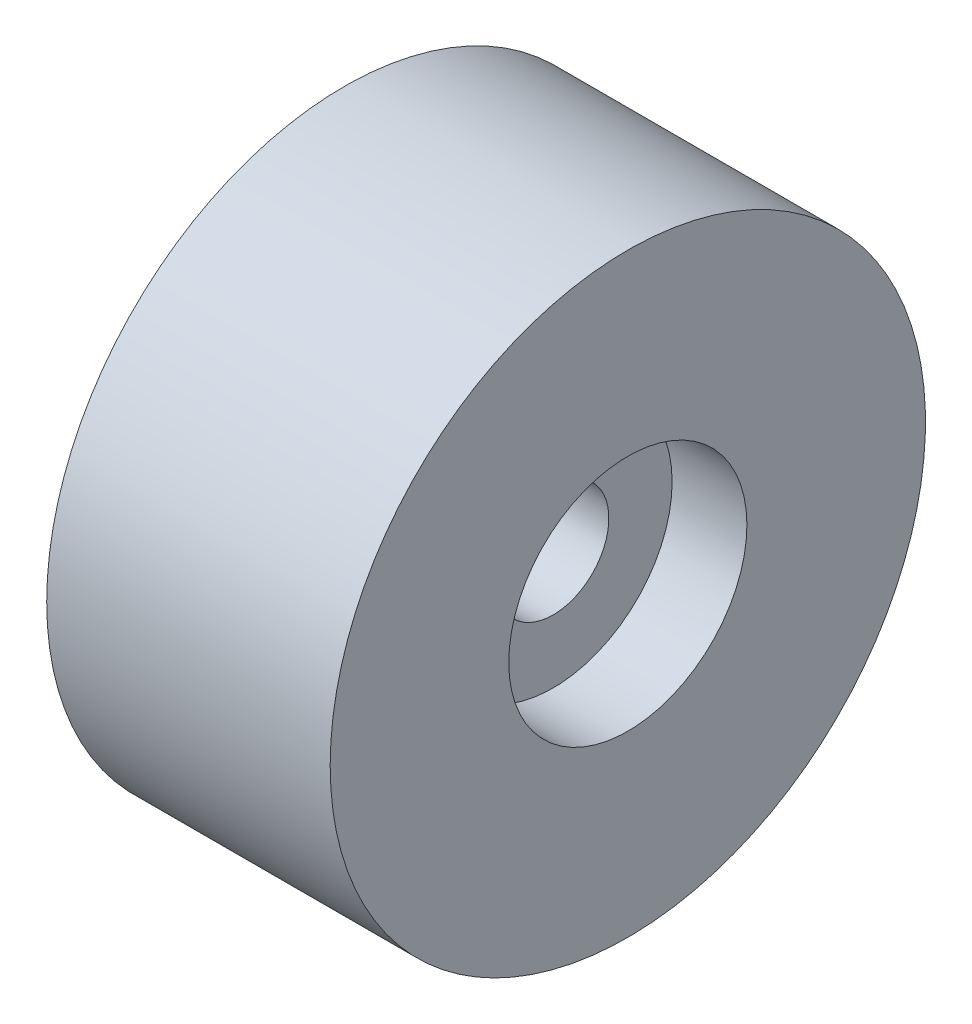
ISO-10303-21;
HEADER;
FILE_DESCRIPTION(('STEP AP214'),'2;1');
FILE_NAME('part.step','',(''),(''),'','','');
FILE_SCHEMA(('AUTOMOTIVE_DESIGN { 1 0 10303 214 1 1 1 1 }'));
ENDSEC;
DATA;
#1=APPLICATION_CONTEXT('core data for automotive mechanical design processes');
#2=APPLICATION_PROTOCOL_DEFINITION('international standard','automotive_design',2000,#1);
#3=PRODUCT_CONTEXT('',#1,'mechanical');
#4=PRODUCT('Part','Part','',(#3));
#5=PRODUCT_RELATED_PRODUCT_CATEGORY('part','',(#4));
#6=PRODUCT_DEFINITION_FORMATION('','',#4);
#7=PRODUCT_DEFINITION_CONTEXT('part definition',#1,'design');
#8=PRODUCT_DEFINITION('design','',#6,#7);
#9=PRODUCT_DEFINITION_SHAPE('','',#8);
#10=(LENGTH_UNIT() NAMED_UNIT(*) SI_UNIT(.MILLI.,.METRE.));
#11=(NAMED_UNIT(*) PLANE_ANGLE_UNIT() SI_UNIT($,.RADIAN.));
#12=(NAMED_UNIT(*) SI_UNIT($,.STERADIAN.) SOLID_ANGLE_UNIT());
#13=UNCERTAINTY_MEASURE_WITH_UNIT(LENGTH_MEASURE(1.E-05),#10,'distance_accuracy_value','');
#14=(GEOMETRIC_REPRESENTATION_CONTEXT(3) GLOBAL_UNCERTAINTY_ASSIGNED_CONTEXT((#13)) GLOBAL_UNIT_ASSIGNED_CONTEXT((#10,
#11,#12)) REPRESENTATION_CONTEXT('',''));
#15=CARTESIAN_POINT('',(0.,0.,0.));
#16=DIRECTION('',(0.,0.,1.));
#17=DIRECTION('',(1.,0.,0.));
#18=AXIS2_PLACEMENT_3D('',#15,#16,#17);
#19=CARTESIAN_POINT('',(-62.8571428571427,0.,0.));
#20=DIRECTION('',(-1.,0.,0.));
#21=DIRECTION('',(0.,0.,1.));
#22=AXIS2_PLACEMENT_3D('',#19,#20,#21);
#23=CYLINDRICAL_SURFACE('',#22,133.35);
#24=CARTESIAN_POINT('',(-63.5,0.,0.));
#25=DIRECTION('',(-1.,0.,0.));
#26=DIRECTION('',(0.,0.,1.));
#27=AXIS2_PLACEMENT_3D('',#24,#25,#26);
#28=CIRCLE('',#27,133.35);
#29=CARTESIAN_POINT('',(-63.5,0.,133.35));
#30=VERTEX_POINT('',#29);
#31=EDGE_CURVE('E10',#30,#30,#28,.T.);
#32=ORIENTED_EDGE('',*,*,#31,.F.);
#33=EDGE_LOOP('',(#32));
#34=FACE_BOUND('',#33,.T.);
#35=CARTESIAN_POINT('',(63.5,0.,0.));
#36=DIRECTION('',(-1.,0.,0.));
#37=DIRECTION('',(0.,0.,1.));
#38=AXIS2_PLACEMENT_3D('',#35,#36,#37);
#39=CIRCLE('',#38,133.35);
#40=CARTESIAN_POINT('',(63.5,0.,133.35));
#41=VERTEX_POINT('',#40);
#42=EDGE_CURVE('E63',#41,#41,#39,.T.);
#43=ORIENTED_EDGE('',*,*,#42,.T.);
#44=EDGE_LOOP('',(#43));
#45=FACE_BOUND('',#44,.T.);
#46=ADVANCED_FACE('F40',(#34,#45),#23,.T.);
#47=CARTESIAN_POINT('',(-63.5,-133.35,0.));
#48=DIRECTION('',(-1.,0.,0.));
#49=DIRECTION('',(0.,0.,1.));
#50=AXIS2_PLACEMENT_3D('',#47,#48,#49);
#51=PLANE('',#50);
#52=ORIENTED_EDGE('',*,*,#31,.T.);
#53=EDGE_LOOP('',(#52));
#54=FACE_BOUND('',#53,.T.);
#55=CARTESIAN_POINT('',(-63.5,0.,0.));
#56=DIRECTION('',(-1.,0.,0.));
#57=DIRECTION('',(0.,0.,1.));
#58=AXIS2_PLACEMENT_3D('',#55,#56,#57);
#59=CIRCLE('',#58,53.35);
#60=CARTESIAN_POINT('',(-63.5,0.,53.35));
#61=VERTEX_POINT('',#60);
#62=EDGE_CURVE('E47',#61,#61,#59,.T.);
#63=ORIENTED_EDGE('',*,*,#62,.F.);
#64=EDGE_LOOP('',(#63));
#65=FACE_BOUND('',#64,.T.);
#66=ADVANCED_FACE('F99',(#54,#65),#51,.T.);
#67=CARTESIAN_POINT('',(-62.8571428571427,0.,0.));
#68=DIRECTION('',(-1.,0.,0.));
#69=DIRECTION('',(0.,0.,1.));
#70=AXIS2_PLACEMENT_3D('',#67,#68,#69);
#71=CYLINDRICAL_SURFACE('',#70,53.35);
#72=ORIENTED_EDGE('',*,*,#62,.T.);
#73=EDGE_LOOP('',(#72));
#74=FACE_BOUND('',#73,.T.);
#75=CARTESIAN_POINT('',(-30.,0.,0.));
#76=DIRECTION('',(-1.,0.,0.));
#77=DIRECTION('',(0.,0.,1.));
#78=AXIS2_PLACEMENT_3D('',#75,#76,#77);
#79=CIRCLE('',#78,53.35);
#80=CARTESIAN_POINT('',(-30.,0.,53.35));
#81=VERTEX_POINT('',#80);
#82=EDGE_CURVE('E52',#81,#81,#79,.T.);
#83=ORIENTED_EDGE('',*,*,#82,.F.);
#84=EDGE_LOOP('',(#83));
#85=FACE_BOUND('',#84,.T.);
#86=ADVANCED_FACE('F95',(#74,#85),#71,.F.);
#87=CARTESIAN_POINT('',(-30.,-53.35,0.));
#88=DIRECTION('',(-1.,0.,0.));
#89=DIRECTION('',(0.,0.,1.));
#90=AXIS2_PLACEMENT_3D('',#87,#88,#89);
#91=PLANE('',#90);
#92=ORIENTED_EDGE('',*,*,#82,.T.);
#93=EDGE_LOOP('',(#92));
#94=FACE_BOUND('',#93,.T.);
#95=CARTESIAN_POINT('',(-30.,0.,0.));
#96=DIRECTION('',(-1.,0.,0.));
#97=DIRECTION('',(0.,0.,1.));
#98=AXIS2_PLACEMENT_3D('',#95,#96,#97);
#99=CIRCLE('',#98,25.);
#100=CARTESIAN_POINT('',(-30.,0.,25.));
#101=VERTEX_POINT('',#100);
#102=EDGE_CURVE('E57',#101,#101,#99,.T.);
#103=ORIENTED_EDGE('',*,*,#102,.F.);
#104=EDGE_LOOP('',(#103));
#105=FACE_BOUND('',#104,.T.);
#106=ADVANCED_FACE('F85',(#94,#105),#91,.T.);
#107=CARTESIAN_POINT('',(-62.8571428571427,0.,0.));
#108=DIRECTION('',(-1.,0.,0.));
#109=DIRECTION('',(0.,0.,1.));
#110=AXIS2_PLACEMENT_3D('',#107,#108,#109);
#111=CYLINDRICAL_SURFACE('',#110,25.);
#112=ORIENTED_EDGE('',*,*,#102,.T.);
#113=EDGE_LOOP('',(#112));
#114=FACE_BOUND('',#113,.T.);
#115=CARTESIAN_POINT('',(30.,0.,0.));
#116=DIRECTION('',(-1.,0.,0.));
#117=DIRECTION('',(0.,0.,1.));
#118=AXIS2_PLACEMENT_3D('',#115,#116,#117);
#119=CIRCLE('',#118,25.);
#120=CARTESIAN_POINT('',(30.,0.,25.));
#121=VERTEX_POINT('',#120);
#122=EDGE_CURVE('E75',#121,#121,#119,.T.);
#123=ORIENTED_EDGE('',*,*,#122,.F.);
#124=EDGE_LOOP('',(#123));
#125=FACE_BOUND('',#124,.T.);
#126=ADVANCED_FACE('F82',(#114,#125),#111,.F.);
#127=CARTESIAN_POINT('',(63.5,-133.35,0.));
#128=DIRECTION('',(1.,0.,0.));
#129=DIRECTION('',(0.,0.,1.));
#130=AXIS2_PLACEMENT_3D('',#127,#128,#129);
#131=PLANE('',#130);
#132=ORIENTED_EDGE('',*,*,#42,.F.);
#133=EDGE_LOOP('',(#132));
#134=FACE_BOUND('',#133,.T.);
#135=CARTESIAN_POINT('',(63.5,0.,0.));
#136=DIRECTION('',(-1.,0.,0.));
#137=DIRECTION('',(0.,0.,1.));
#138=AXIS2_PLACEMENT_3D('',#135,#136,#137);
#139=CIRCLE('',#138,53.35);
#140=CARTESIAN_POINT('',(63.5,0.,53.35));
#141=VERTEX_POINT('',#140);
#142=EDGE_CURVE('E67',#141,#141,#139,.T.);
#143=ORIENTED_EDGE('',*,*,#142,.T.);
#144=EDGE_LOOP('',(#143));
#145=FACE_BOUND('',#144,.T.);
#146=ADVANCED_FACE('F84',(#134,#145),#131,.T.);
#147=CARTESIAN_POINT('',(62.8571428571427,0.,0.));
#148=DIRECTION('',(1.,0.,0.));
#149=DIRECTION('',(0.,0.,1.));
#150=AXIS2_PLACEMENT_3D('',#147,#148,#149);
#151=CYLINDRICAL_SURFACE('',#150,53.35);
#152=ORIENTED_EDGE('',*,*,#142,.F.);
#153=EDGE_LOOP('',(#152));
#154=FACE_BOUND('',#153,.T.);
#155=CARTESIAN_POINT('',(30.,0.,0.));
#156=DIRECTION('',(-1.,0.,0.));
#157=DIRECTION('',(0.,0.,1.));
#158=AXIS2_PLACEMENT_3D('',#155,#156,#157);
#159=CIRCLE('',#158,53.35);
#160=CARTESIAN_POINT('',(30.,0.,53.35));
#161=VERTEX_POINT('',#160);
#162=EDGE_CURVE('E71',#161,#161,#159,.T.);
#163=ORIENTED_EDGE('',*,*,#162,.T.);
#164=EDGE_LOOP('',(#163));
#165=FACE_BOUND('',#164,.T.);
#166=ADVANCED_FACE('F92',(#154,#165),#151,.F.);
#167=CARTESIAN_POINT('',(30.,-53.35,0.));
#168=DIRECTION('',(1.,0.,0.));
#169=DIRECTION('',(0.,0.,1.));
#170=AXIS2_PLACEMENT_3D('',#167,#168,#169);
#171=PLANE('',#170);
#172=ORIENTED_EDGE('',*,*,#162,.F.);
#173=EDGE_LOOP('',(#172));
#174=FACE_BOUND('',#173,.T.);
#175=ORIENTED_EDGE('',*,*,#122,.T.);
#176=EDGE_LOOP('',(#175));
#177=FACE_BOUND('',#176,.T.);
#178=ADVANCED_FACE('F80',(#174,#177),#171,.T.);
#179=CLOSED_SHELL('',(#46,#66,#86,#106,#126,#146,#166,#178));
#180=MANIFOLD_SOLID_BREP('B2',#179);
#181=ADVANCED_BREP_SHAPE_REPRESENTATION('',(#18,#180),#14);
#182=SHAPE_DEFINITION_REPRESENTATION(#9,#181);
ENDSEC;
END-ISO-10303-21;
